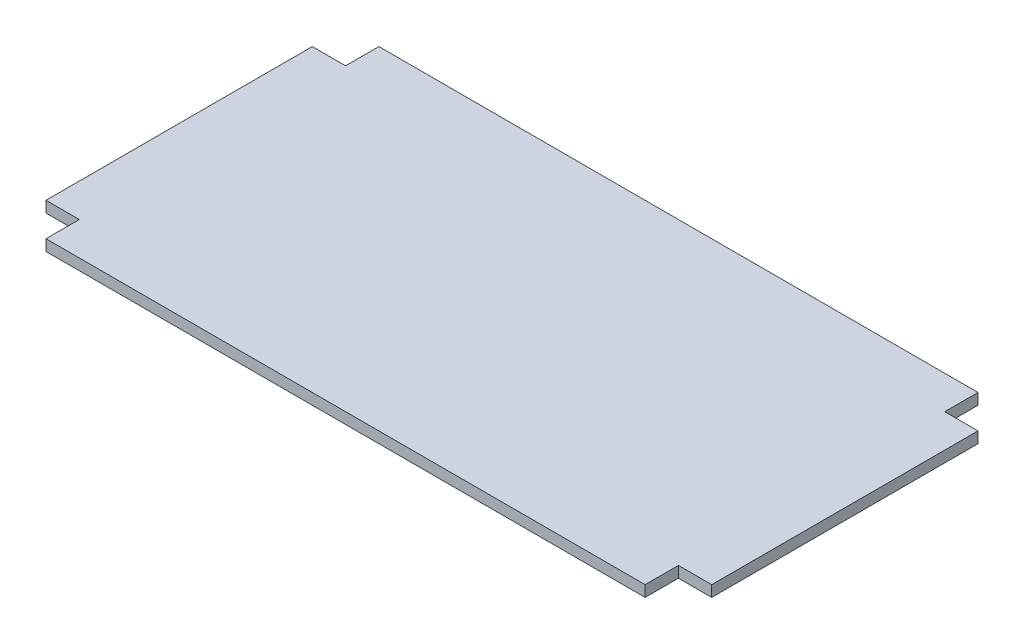
ISO-10303-21;
HEADER;
FILE_DESCRIPTION(('STEP AP214'),'2;1');
FILE_NAME('part.step','',(''),(''),'','','');
FILE_SCHEMA(('AUTOMOTIVE_DESIGN { 1 0 10303 214 1 1 1 1 }'));
ENDSEC;
DATA;
#1=APPLICATION_CONTEXT('core data for automotive mechanical design processes');
#2=APPLICATION_PROTOCOL_DEFINITION('international standard','automotive_design',2000,#1);
#3=PRODUCT_CONTEXT('',#1,'mechanical');
#4=PRODUCT('Part','Part','',(#3));
#5=PRODUCT_RELATED_PRODUCT_CATEGORY('part','',(#4));
#6=PRODUCT_DEFINITION_FORMATION('','',#4);
#7=PRODUCT_DEFINITION_CONTEXT('part definition',#1,'design');
#8=PRODUCT_DEFINITION('design','',#6,#7);
#9=PRODUCT_DEFINITION_SHAPE('','',#8);
#10=(LENGTH_UNIT() NAMED_UNIT(*) SI_UNIT(.MILLI.,.METRE.));
#11=(NAMED_UNIT(*) PLANE_ANGLE_UNIT() SI_UNIT($,.RADIAN.));
#12=(NAMED_UNIT(*) SI_UNIT($,.STERADIAN.) SOLID_ANGLE_UNIT());
#13=UNCERTAINTY_MEASURE_WITH_UNIT(LENGTH_MEASURE(1.E-05),#10,'distance_accuracy_value','');
#14=(GEOMETRIC_REPRESENTATION_CONTEXT(3) GLOBAL_UNCERTAINTY_ASSIGNED_CONTEXT((#13)) GLOBAL_UNIT_ASSIGNED_CONTEXT((#10,
#11,#12)) REPRESENTATION_CONTEXT('',''));
#15=CARTESIAN_POINT('',(0.,0.,0.));
#16=DIRECTION('',(0.,0.,1.));
#17=DIRECTION('',(1.,0.,0.));
#18=AXIS2_PLACEMENT_3D('',#15,#16,#17);
#19=CARTESIAN_POINT('',(381.,12.7,0.));
#20=DIRECTION('',(1.,0.,0.));
#21=DIRECTION('',(0.,0.,-1.));
#22=AXIS2_PLACEMENT_3D('',#19,#20,#21);
#23=PLANE('',#22);
#24=DIRECTION('',(0.,0.,1.));
#25=VECTOR('',#24,1.);
#26=CARTESIAN_POINT('',(381.,0.,0.));
#27=LINE('',#26,#25);
#28=CARTESIAN_POINT('',(381.,0.,-152.4));
#29=VERTEX_POINT('',#28);
#30=CARTESIAN_POINT('',(381.,0.,152.4));
#31=VERTEX_POINT('',#30);
#32=EDGE_CURVE('E163',#29,#31,#27,.T.);
#33=ORIENTED_EDGE('',*,*,#32,.F.);
#34=DIRECTION('',(0.,-1.,0.));
#35=VECTOR('',#34,1.);
#36=CARTESIAN_POINT('',(381.,12.7,-152.4));
#37=LINE('',#36,#35);
#38=CARTESIAN_POINT('',(381.,12.7,-152.4));
#39=VERTEX_POINT('',#38);
#40=EDGE_CURVE('E11',#39,#29,#37,.T.);
#41=ORIENTED_EDGE('',*,*,#40,.F.);
#42=DIRECTION('',(0.,0.,1.));
#43=VECTOR('',#42,1.);
#44=CARTESIAN_POINT('',(381.,12.7,0.));
#45=LINE('',#44,#43);
#46=CARTESIAN_POINT('',(381.,12.7,152.4));
#47=VERTEX_POINT('',#46);
#48=EDGE_CURVE('E206',#39,#47,#45,.T.);
#49=ORIENTED_EDGE('',*,*,#48,.T.);
#50=DIRECTION('',(0.,-1.,0.));
#51=VECTOR('',#50,1.);
#52=CARTESIAN_POINT('',(381.,12.7,152.4));
#53=LINE('',#52,#51);
#54=EDGE_CURVE('E58',#47,#31,#53,.T.);
#55=ORIENTED_EDGE('',*,*,#54,.T.);
#56=EDGE_LOOP('',(#33,#41,#49,#55));
#57=FACE_BOUND('',#56,.T.);
#58=ADVANCED_FACE('F41',(#57),#23,.T.);
#59=CARTESIAN_POINT('',(0.,12.7,-152.4));
#60=DIRECTION('',(0.,0.,1.));
#61=DIRECTION('',(1.,0.,0.));
#62=AXIS2_PLACEMENT_3D('',#59,#60,#61);
#63=PLANE('',#62);
#64=DIRECTION('',(-1.,0.,0.));
#65=VECTOR('',#64,1.);
#66=CARTESIAN_POINT('',(0.,0.,-152.4));
#67=LINE('',#66,#65);
#68=CARTESIAN_POINT('',(342.9,0.,-152.4));
#69=VERTEX_POINT('',#68);
#70=EDGE_CURVE('E166',#29,#69,#67,.T.);
#71=ORIENTED_EDGE('',*,*,#70,.T.);
#72=DIRECTION('',(0.,-1.,0.));
#73=VECTOR('',#72,1.);
#74=CARTESIAN_POINT('',(342.9,12.7,-152.4));
#75=LINE('',#74,#73);
#76=CARTESIAN_POINT('',(342.9,12.7,-152.4));
#77=VERTEX_POINT('',#76);
#78=EDGE_CURVE('E50',#77,#69,#75,.T.);
#79=ORIENTED_EDGE('',*,*,#78,.F.);
#80=DIRECTION('',(-1.,0.,0.));
#81=VECTOR('',#80,1.);
#82=CARTESIAN_POINT('',(0.,12.7,-152.4));
#83=LINE('',#82,#81);
#84=EDGE_CURVE('E252',#39,#77,#83,.T.);
#85=ORIENTED_EDGE('',*,*,#84,.F.);
#86=ORIENTED_EDGE('',*,*,#40,.T.);
#87=EDGE_LOOP('',(#71,#79,#85,#86));
#88=FACE_BOUND('',#87,.T.);
#89=ADVANCED_FACE('F241',(#88),#63,.F.);
#90=CARTESIAN_POINT('',(342.9,12.7,0.));
#91=DIRECTION('',(1.,0.,0.));
#92=DIRECTION('',(0.,0.,-1.));
#93=AXIS2_PLACEMENT_3D('',#90,#91,#92);
#94=PLANE('',#93);
#95=DIRECTION('',(0.,0.,1.));
#96=VECTOR('',#95,1.);
#97=CARTESIAN_POINT('',(342.9,0.,0.));
#98=LINE('',#97,#96);
#99=CARTESIAN_POINT('',(342.9,0.,-190.5));
#100=VERTEX_POINT('',#99);
#101=EDGE_CURVE('E170',#100,#69,#98,.T.);
#102=ORIENTED_EDGE('',*,*,#101,.F.);
#103=DIRECTION('',(0.,-1.,0.));
#104=VECTOR('',#103,1.);
#105=CARTESIAN_POINT('',(342.9,12.7,-190.5));
#106=LINE('',#105,#104);
#107=CARTESIAN_POINT('',(342.9,12.7,-190.5));
#108=VERTEX_POINT('',#107);
#109=EDGE_CURVE('E229',#108,#100,#106,.T.);
#110=ORIENTED_EDGE('',*,*,#109,.F.);
#111=DIRECTION('',(0.,0.,1.));
#112=VECTOR('',#111,1.);
#113=CARTESIAN_POINT('',(342.9,12.7,0.));
#114=LINE('',#113,#112);
#115=EDGE_CURVE('E238',#108,#77,#114,.T.);
#116=ORIENTED_EDGE('',*,*,#115,.T.);
#117=ORIENTED_EDGE('',*,*,#78,.T.);
#118=EDGE_LOOP('',(#102,#110,#116,#117));
#119=FACE_BOUND('',#118,.T.);
#120=ADVANCED_FACE('F236',(#119),#94,.T.);
#121=CARTESIAN_POINT('',(0.,12.7,-190.5));
#122=DIRECTION('',(0.,0.,-1.));
#123=DIRECTION('',(-1.,0.,0.));
#124=AXIS2_PLACEMENT_3D('',#121,#122,#123);
#125=PLANE('',#124);
#126=DIRECTION('',(1.,0.,0.));
#127=VECTOR('',#126,1.);
#128=CARTESIAN_POINT('',(0.,0.,-190.5));
#129=LINE('',#128,#127);
#130=CARTESIAN_POINT('',(-342.9,0.,-190.5));
#131=VERTEX_POINT('',#130);
#132=EDGE_CURVE('E174',#131,#100,#129,.T.);
#133=ORIENTED_EDGE('',*,*,#132,.F.);
#134=DIRECTION('',(0.,-1.,0.));
#135=VECTOR('',#134,1.);
#136=CARTESIAN_POINT('',(-342.9,12.7,-190.5));
#137=LINE('',#136,#135);
#138=CARTESIAN_POINT('',(-342.9,12.7,-190.5));
#139=VERTEX_POINT('',#138);
#140=EDGE_CURVE('E226',#139,#131,#137,.T.);
#141=ORIENTED_EDGE('',*,*,#140,.F.);
#142=DIRECTION('',(1.,0.,0.));
#143=VECTOR('',#142,1.);
#144=CARTESIAN_POINT('',(0.,12.7,-190.5));
#145=LINE('',#144,#143);
#146=EDGE_CURVE('E251',#139,#108,#145,.T.);
#147=ORIENTED_EDGE('',*,*,#146,.T.);
#148=ORIENTED_EDGE('',*,*,#109,.T.);
#149=EDGE_LOOP('',(#133,#141,#147,#148));
#150=FACE_BOUND('',#149,.T.);
#151=ADVANCED_FACE('F247',(#150),#125,.T.);
#152=CARTESIAN_POINT('',(-342.9,12.7,0.));
#153=DIRECTION('',(1.,0.,0.));
#154=DIRECTION('',(0.,0.,-1.));
#155=AXIS2_PLACEMENT_3D('',#152,#153,#154);
#156=PLANE('',#155);
#157=DIRECTION('',(0.,0.,1.));
#158=VECTOR('',#157,1.);
#159=CARTESIAN_POINT('',(-342.9,0.,0.));
#160=LINE('',#159,#158);
#161=CARTESIAN_POINT('',(-342.9,0.,-152.4));
#162=VERTEX_POINT('',#161);
#163=EDGE_CURVE('E178',#131,#162,#160,.T.);
#164=ORIENTED_EDGE('',*,*,#163,.T.);
#165=DIRECTION('',(0.,-1.,0.));
#166=VECTOR('',#165,1.);
#167=CARTESIAN_POINT('',(-342.9,12.7,-152.4));
#168=LINE('',#167,#166);
#169=CARTESIAN_POINT('',(-342.9,12.7,-152.4));
#170=VERTEX_POINT('',#169);
#171=EDGE_CURVE('E223',#170,#162,#168,.T.);
#172=ORIENTED_EDGE('',*,*,#171,.F.);
#173=DIRECTION('',(0.,0.,1.));
#174=VECTOR('',#173,1.);
#175=CARTESIAN_POINT('',(-342.9,12.7,0.));
#176=LINE('',#175,#174);
#177=EDGE_CURVE('E257',#139,#170,#176,.T.);
#178=ORIENTED_EDGE('',*,*,#177,.F.);
#179=ORIENTED_EDGE('',*,*,#140,.T.);
#180=EDGE_LOOP('',(#164,#172,#178,#179));
#181=FACE_BOUND('',#180,.T.);
#182=ADVANCED_FACE('F300',(#181),#156,.F.);
#183=CARTESIAN_POINT('',(0.,12.7,-152.4));
#184=DIRECTION('',(0.,0.,-1.));
#185=DIRECTION('',(-1.,0.,0.));
#186=AXIS2_PLACEMENT_3D('',#183,#184,#185);
#187=PLANE('',#186);
#188=DIRECTION('',(1.,0.,0.));
#189=VECTOR('',#188,1.);
#190=CARTESIAN_POINT('',(0.,0.,-152.4));
#191=LINE('',#190,#189);
#192=CARTESIAN_POINT('',(-381.,0.,-152.4));
#193=VERTEX_POINT('',#192);
#194=EDGE_CURVE('E182',#193,#162,#191,.T.);
#195=ORIENTED_EDGE('',*,*,#194,.F.);
#196=DIRECTION('',(0.,-1.,0.));
#197=VECTOR('',#196,1.);
#198=CARTESIAN_POINT('',(-381.,12.7,-152.4));
#199=LINE('',#198,#197);
#200=CARTESIAN_POINT('',(-381.,12.7,-152.4));
#201=VERTEX_POINT('',#200);
#202=EDGE_CURVE('E220',#201,#193,#199,.T.);
#203=ORIENTED_EDGE('',*,*,#202,.F.);
#204=DIRECTION('',(1.,0.,0.));
#205=VECTOR('',#204,1.);
#206=CARTESIAN_POINT('',(0.,12.7,-152.4));
#207=LINE('',#206,#205);
#208=EDGE_CURVE('E264',#201,#170,#207,.T.);
#209=ORIENTED_EDGE('',*,*,#208,.T.);
#210=ORIENTED_EDGE('',*,*,#171,.T.);
#211=EDGE_LOOP('',(#195,#203,#209,#210));
#212=FACE_BOUND('',#211,.T.);
#213=ADVANCED_FACE('F303',(#212),#187,.T.);
#214=CARTESIAN_POINT('',(-381.,12.7,0.));
#215=DIRECTION('',(1.,0.,0.));
#216=DIRECTION('',(0.,0.,-1.));
#217=AXIS2_PLACEMENT_3D('',#214,#215,#216);
#218=PLANE('',#217);
#219=DIRECTION('',(0.,0.,1.));
#220=VECTOR('',#219,1.);
#221=CARTESIAN_POINT('',(-381.,0.,0.));
#222=LINE('',#221,#220);
#223=CARTESIAN_POINT('',(-381.,0.,152.4));
#224=VERTEX_POINT('',#223);
#225=EDGE_CURVE('E186',#193,#224,#222,.T.);
#226=ORIENTED_EDGE('',*,*,#225,.T.);
#227=DIRECTION('',(0.,-1.,0.));
#228=VECTOR('',#227,1.);
#229=CARTESIAN_POINT('',(-381.,12.7,152.4));
#230=LINE('',#229,#228);
#231=CARTESIAN_POINT('',(-381.,12.7,152.4));
#232=VERTEX_POINT('',#231);
#233=EDGE_CURVE('E216',#232,#224,#230,.T.);
#234=ORIENTED_EDGE('',*,*,#233,.F.);
#235=DIRECTION('',(0.,0.,1.));
#236=VECTOR('',#235,1.);
#237=CARTESIAN_POINT('',(-381.,12.7,0.));
#238=LINE('',#237,#236);
#239=EDGE_CURVE('E268',#201,#232,#238,.T.);
#240=ORIENTED_EDGE('',*,*,#239,.F.);
#241=ORIENTED_EDGE('',*,*,#202,.T.);
#242=EDGE_LOOP('',(#226,#234,#240,#241));
#243=FACE_BOUND('',#242,.T.);
#244=ADVANCED_FACE('F307',(#243),#218,.F.);
#245=CARTESIAN_POINT('',(0.,12.7,152.4));
#246=DIRECTION('',(0.,0.,-1.));
#247=DIRECTION('',(-1.,0.,0.));
#248=AXIS2_PLACEMENT_3D('',#245,#246,#247);
#249=PLANE('',#248);
#250=DIRECTION('',(1.,0.,0.));
#251=VECTOR('',#250,1.);
#252=CARTESIAN_POINT('',(0.,0.,152.4));
#253=LINE('',#252,#251);
#254=CARTESIAN_POINT('',(-342.9,0.,152.4));
#255=VERTEX_POINT('',#254);
#256=EDGE_CURVE('E189',#224,#255,#253,.T.);
#257=ORIENTED_EDGE('',*,*,#256,.T.);
#258=DIRECTION('',(0.,-1.,0.));
#259=VECTOR('',#258,1.);
#260=CARTESIAN_POINT('',(-342.9,12.7,152.4));
#261=LINE('',#260,#259);
#262=CARTESIAN_POINT('',(-342.9,12.7,152.4));
#263=VERTEX_POINT('',#262);
#264=EDGE_CURVE('E213',#263,#255,#261,.T.);
#265=ORIENTED_EDGE('',*,*,#264,.F.);
#266=DIRECTION('',(1.,0.,0.));
#267=VECTOR('',#266,1.);
#268=CARTESIAN_POINT('',(0.,12.7,152.4));
#269=LINE('',#268,#267);
#270=EDGE_CURVE('E271',#232,#263,#269,.T.);
#271=ORIENTED_EDGE('',*,*,#270,.F.);
#272=ORIENTED_EDGE('',*,*,#233,.T.);
#273=EDGE_LOOP('',(#257,#265,#271,#272));
#274=FACE_BOUND('',#273,.T.);
#275=ADVANCED_FACE('F311',(#274),#249,.F.);
#276=CARTESIAN_POINT('',(-342.9,12.7,0.));
#277=DIRECTION('',(-1.,0.,0.));
#278=DIRECTION('',(0.,0.,1.));
#279=AXIS2_PLACEMENT_3D('',#276,#277,#278);
#280=PLANE('',#279);
#281=DIRECTION('',(0.,0.,-1.));
#282=VECTOR('',#281,1.);
#283=CARTESIAN_POINT('',(-342.9,0.,0.));
#284=LINE('',#283,#282);
#285=CARTESIAN_POINT('',(-342.9,0.,190.5));
#286=VERTEX_POINT('',#285);
#287=EDGE_CURVE('E193',#286,#255,#284,.T.);
#288=ORIENTED_EDGE('',*,*,#287,.F.);
#289=DIRECTION('',(0.,-1.,0.));
#290=VECTOR('',#289,1.);
#291=CARTESIAN_POINT('',(-342.9,12.7,190.5));
#292=LINE('',#291,#290);
#293=CARTESIAN_POINT('',(-342.9,12.7,190.5));
#294=VERTEX_POINT('',#293);
#295=EDGE_CURVE('E153',#294,#286,#292,.T.);
#296=ORIENTED_EDGE('',*,*,#295,.F.);
#297=DIRECTION('',(0.,0.,-1.));
#298=VECTOR('',#297,1.);
#299=CARTESIAN_POINT('',(-342.9,12.7,0.));
#300=LINE('',#299,#298);
#301=EDGE_CURVE('E141',#294,#263,#300,.T.);
#302=ORIENTED_EDGE('',*,*,#301,.T.);
#303=ORIENTED_EDGE('',*,*,#264,.T.);
#304=EDGE_LOOP('',(#288,#296,#302,#303));
#305=FACE_BOUND('',#304,.T.);
#306=ADVANCED_FACE('F276',(#305),#280,.T.);
#307=CARTESIAN_POINT('',(0.,12.7,190.5));
#308=DIRECTION('',(0.,0.,-1.));
#309=DIRECTION('',(-1.,0.,0.));
#310=AXIS2_PLACEMENT_3D('',#307,#308,#309);
#311=PLANE('',#310);
#312=DIRECTION('',(1.,0.,0.));
#313=VECTOR('',#312,1.);
#314=CARTESIAN_POINT('',(0.,0.,190.5));
#315=LINE('',#314,#313);
#316=CARTESIAN_POINT('',(342.9,0.,190.5));
#317=VERTEX_POINT('',#316);
#318=EDGE_CURVE('E149',#286,#317,#315,.T.);
#319=ORIENTED_EDGE('',*,*,#318,.T.);
#320=DIRECTION('',(0.,-1.,0.));
#321=VECTOR('',#320,1.);
#322=CARTESIAN_POINT('',(342.9,12.7,190.5));
#323=LINE('',#322,#321);
#324=CARTESIAN_POINT('',(342.9,12.7,190.5));
#325=VERTEX_POINT('',#324);
#326=EDGE_CURVE('E146',#325,#317,#323,.T.);
#327=ORIENTED_EDGE('',*,*,#326,.F.);
#328=DIRECTION('',(1.,0.,0.));
#329=VECTOR('',#328,1.);
#330=CARTESIAN_POINT('',(0.,12.7,190.5));
#331=LINE('',#330,#329);
#332=EDGE_CURVE('E133',#294,#325,#331,.T.);
#333=ORIENTED_EDGE('',*,*,#332,.F.);
#334=ORIENTED_EDGE('',*,*,#295,.T.);
#335=EDGE_LOOP('',(#319,#327,#333,#334));
#336=FACE_BOUND('',#335,.T.);
#337=ADVANCED_FACE('F147',(#336),#311,.F.);
#338=CARTESIAN_POINT('',(342.9,12.7,0.));
#339=DIRECTION('',(-1.,0.,0.));
#340=DIRECTION('',(0.,0.,1.));
#341=AXIS2_PLACEMENT_3D('',#338,#339,#340);
#342=PLANE('',#341);
#343=DIRECTION('',(0.,0.,-1.));
#344=VECTOR('',#343,1.);
#345=CARTESIAN_POINT('',(342.9,0.,0.));
#346=LINE('',#345,#344);
#347=CARTESIAN_POINT('',(342.9,0.,152.4));
#348=VERTEX_POINT('',#347);
#349=EDGE_CURVE('E199',#317,#348,#346,.T.);
#350=ORIENTED_EDGE('',*,*,#349,.T.);
#351=DIRECTION('',(0.,-1.,0.));
#352=VECTOR('',#351,1.);
#353=CARTESIAN_POINT('',(342.9,12.7,152.4));
#354=LINE('',#353,#352);
#355=CARTESIAN_POINT('',(342.9,12.7,152.4));
#356=VERTEX_POINT('',#355);
#357=EDGE_CURVE('E96',#356,#348,#354,.T.);
#358=ORIENTED_EDGE('',*,*,#357,.F.);
#359=DIRECTION('',(0.,0.,-1.));
#360=VECTOR('',#359,1.);
#361=CARTESIAN_POINT('',(342.9,12.7,0.));
#362=LINE('',#361,#360);
#363=EDGE_CURVE('E139',#325,#356,#362,.T.);
#364=ORIENTED_EDGE('',*,*,#363,.F.);
#365=ORIENTED_EDGE('',*,*,#326,.T.);
#366=EDGE_LOOP('',(#350,#358,#364,#365));
#367=FACE_BOUND('',#366,.T.);
#368=ADVANCED_FACE('F155',(#367),#342,.F.);
#369=CARTESIAN_POINT('',(0.,12.7,152.4));
#370=DIRECTION('',(0.,0.,1.));
#371=DIRECTION('',(1.,0.,0.));
#372=AXIS2_PLACEMENT_3D('',#369,#370,#371);
#373=PLANE('',#372);
#374=DIRECTION('',(-1.,0.,0.));
#375=VECTOR('',#374,1.);
#376=CARTESIAN_POINT('',(0.,0.,152.4));
#377=LINE('',#376,#375);
#378=EDGE_CURVE('E202',#31,#348,#377,.T.);
#379=ORIENTED_EDGE('',*,*,#378,.F.);
#380=ORIENTED_EDGE('',*,*,#54,.F.);
#381=DIRECTION('',(-1.,0.,0.));
#382=VECTOR('',#381,1.);
#383=CARTESIAN_POINT('',(0.,12.7,152.4));
#384=LINE('',#383,#382);
#385=EDGE_CURVE('E157',#47,#356,#384,.T.);
#386=ORIENTED_EDGE('',*,*,#385,.T.);
#387=ORIENTED_EDGE('',*,*,#357,.T.);
#388=EDGE_LOOP('',(#379,#380,#386,#387));
#389=FACE_BOUND('',#388,.T.);
#390=ADVANCED_FACE('F279',(#389),#373,.T.);
#391=CARTESIAN_POINT('',(0.,12.7,0.));
#392=DIRECTION('',(0.,1.,0.));
#393=DIRECTION('',(0.,0.,1.));
#394=AXIS2_PLACEMENT_3D('',#391,#392,#393);
#395=PLANE('',#394);
#396=ORIENTED_EDGE('',*,*,#48,.F.);
#397=ORIENTED_EDGE('',*,*,#84,.T.);
#398=ORIENTED_EDGE('',*,*,#115,.F.);
#399=ORIENTED_EDGE('',*,*,#146,.F.);
#400=ORIENTED_EDGE('',*,*,#177,.T.);
#401=ORIENTED_EDGE('',*,*,#208,.F.);
#402=ORIENTED_EDGE('',*,*,#239,.T.);
#403=ORIENTED_EDGE('',*,*,#270,.T.);
#404=ORIENTED_EDGE('',*,*,#301,.F.);
#405=ORIENTED_EDGE('',*,*,#332,.T.);
#406=ORIENTED_EDGE('',*,*,#363,.T.);
#407=ORIENTED_EDGE('',*,*,#385,.F.);
#408=EDGE_LOOP('',(#396,#397,#398,#399,#400,#401,#402,#403,#404,#405,#406,#407));
#409=FACE_BOUND('',#408,.T.);
#410=ADVANCED_FACE('F136',(#409),#395,.T.);
#411=CARTESIAN_POINT('',(0.,0.,0.));
#412=DIRECTION('',(0.,1.,0.));
#413=DIRECTION('',(0.,0.,1.));
#414=AXIS2_PLACEMENT_3D('',#411,#412,#413);
#415=PLANE('',#414);
#416=ORIENTED_EDGE('',*,*,#32,.T.);
#417=ORIENTED_EDGE('',*,*,#378,.T.);
#418=ORIENTED_EDGE('',*,*,#349,.F.);
#419=ORIENTED_EDGE('',*,*,#318,.F.);
#420=ORIENTED_EDGE('',*,*,#287,.T.);
#421=ORIENTED_EDGE('',*,*,#256,.F.);
#422=ORIENTED_EDGE('',*,*,#225,.F.);
#423=ORIENTED_EDGE('',*,*,#194,.T.);
#424=ORIENTED_EDGE('',*,*,#163,.F.);
#425=ORIENTED_EDGE('',*,*,#132,.T.);
#426=ORIENTED_EDGE('',*,*,#101,.T.);
#427=ORIENTED_EDGE('',*,*,#70,.F.);
#428=EDGE_LOOP('',(#416,#417,#418,#419,#420,#421,#422,#423,#424,#425,#426,#427));
#429=FACE_BOUND('',#428,.T.);
#430=ADVANCED_FACE('F243',(#429),#415,.F.);
#431=CLOSED_SHELL('',(#58,#89,#120,#151,#182,#213,#244,#275,#306,#337,#368,#390,#410,#430));
#432=MANIFOLD_SOLID_BREP('B2',#431);
#433=ADVANCED_BREP_SHAPE_REPRESENTATION('',(#18,#432),#14);
#434=SHAPE_DEFINITION_REPRESENTATION(#9,#433);
ENDSEC;
END-ISO-10303-21;
